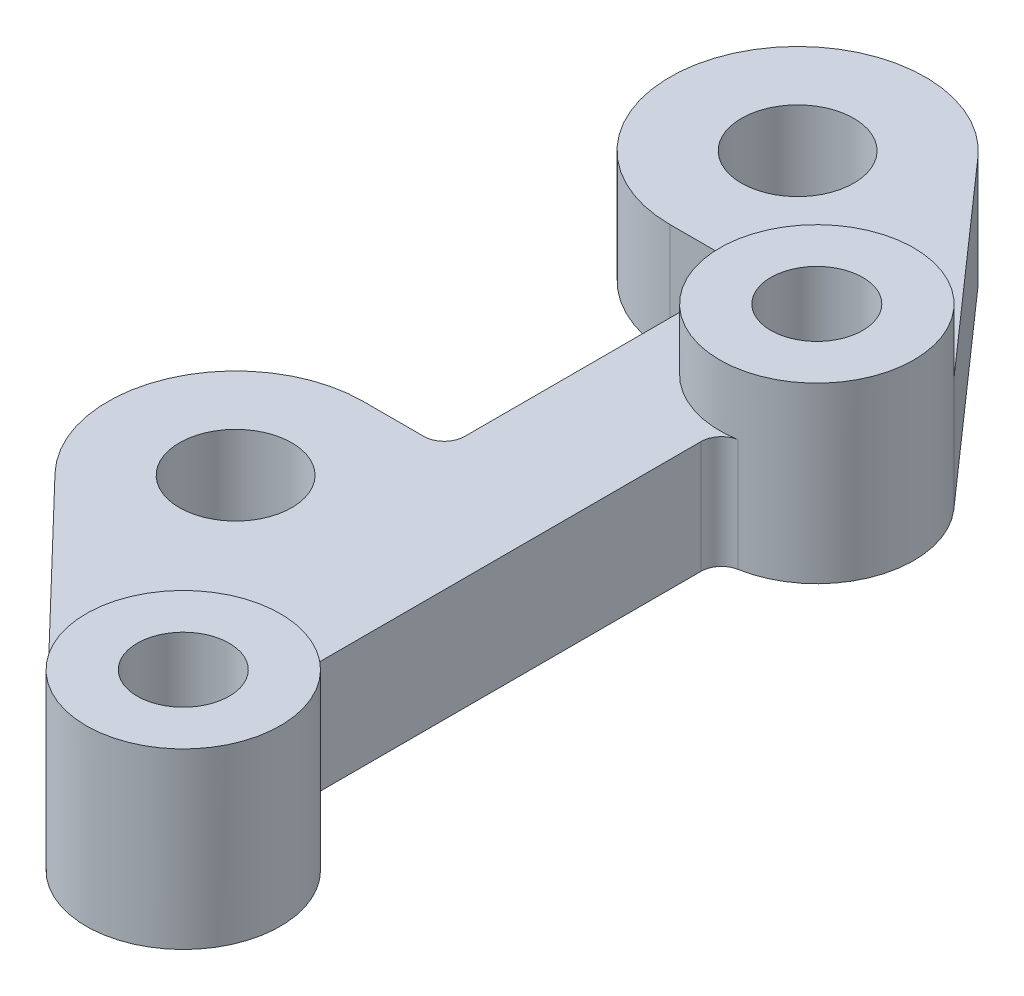
ISO-10303-21;
HEADER;
FILE_DESCRIPTION(('STEP AP214'),'2;1');
FILE_NAME('part.step','',(''),(''),'','','');
FILE_SCHEMA(('AUTOMOTIVE_DESIGN { 1 0 10303 214 1 1 1 1 }'));
ENDSEC;
DATA;
#1=APPLICATION_CONTEXT('core data for automotive mechanical design processes');
#2=APPLICATION_PROTOCOL_DEFINITION('international standard','automotive_design',2000,#1);
#3=PRODUCT_CONTEXT('',#1,'mechanical');
#4=PRODUCT('Part','Part','',(#3));
#5=PRODUCT_RELATED_PRODUCT_CATEGORY('part','',(#4));
#6=PRODUCT_DEFINITION_FORMATION('','',#4);
#7=PRODUCT_DEFINITION_CONTEXT('part definition',#1,'design');
#8=PRODUCT_DEFINITION('design','',#6,#7);
#9=PRODUCT_DEFINITION_SHAPE('','',#8);
#10=(LENGTH_UNIT() NAMED_UNIT(*) SI_UNIT(.MILLI.,.METRE.));
#11=(NAMED_UNIT(*) PLANE_ANGLE_UNIT() SI_UNIT($,.RADIAN.));
#12=(NAMED_UNIT(*) SI_UNIT($,.STERADIAN.) SOLID_ANGLE_UNIT());
#13=UNCERTAINTY_MEASURE_WITH_UNIT(LENGTH_MEASURE(1.E-05),#10,'distance_accuracy_value','');
#14=(GEOMETRIC_REPRESENTATION_CONTEXT(3) GLOBAL_UNCERTAINTY_ASSIGNED_CONTEXT((#13)) GLOBAL_UNIT_ASSIGNED_CONTEXT((#10,
#11,#12)) REPRESENTATION_CONTEXT('',''));
#15=CARTESIAN_POINT('',(0.,0.,0.));
#16=DIRECTION('',(0.,0.,1.));
#17=DIRECTION('',(1.,0.,0.));
#18=AXIS2_PLACEMENT_3D('',#15,#16,#17);
#19=CARTESIAN_POINT('',(-19.9204683724037,11.,-80.0434610192774));
#20=DIRECTION('',(0.,-1.,0.));
#21=DIRECTION('',(0.,0.,-1.));
#22=AXIS2_PLACEMENT_3D('',#19,#20,#21);
#23=PLANE('',#22);
#24=CARTESIAN_POINT('',(-19.9204683724037,11.,-25.0434610192774));
#25=DIRECTION('',(0.,1.,0.));
#26=DIRECTION('',(0.,0.,1.));
#27=AXIS2_PLACEMENT_3D('',#24,#25,#26);
#28=CIRCLE('',#27,5.5);
#29=CARTESIAN_POINT('',(-19.9204683724037,11.,-19.5434610192774));
#30=VERTEX_POINT('',#29);
#31=EDGE_CURVE('E303',#30,#30,#28,.T.);
#32=ORIENTED_EDGE('',*,*,#31,.F.);
#33=EDGE_LOOP('',(#32));
#34=FACE_BOUND('',#33,.T.);
#35=CARTESIAN_POINT('',(-19.9204683724037,11.,-80.0434610192774));
#36=DIRECTION('',(0.,1.,0.));
#37=DIRECTION('',(0.,0.,1.));
#38=AXIS2_PLACEMENT_3D('',#35,#36,#37);
#39=CIRCLE('',#38,5.50000000000001);
#40=CARTESIAN_POINT('',(-19.9204683724037,11.,-74.5434610192773));
#41=VERTEX_POINT('',#40);
#42=EDGE_CURVE('E294',#41,#41,#39,.T.);
#43=ORIENTED_EDGE('',*,*,#42,.F.);
#44=EDGE_LOOP('',(#43));
#45=FACE_BOUND('',#44,.T.);
#46=CARTESIAN_POINT('',(0.,11.,-62.));
#47=DIRECTION('',(0.,1.,0.));
#48=DIRECTION('',(0.,0.,1.));
#49=AXIS2_PLACEMENT_3D('',#46,#47,#48);
#50=CIRCLE('',#49,9.49999999999999);
#51=CARTESIAN_POINT('',(7.12365328024054,11.,-68.2851860706679));
#52=VERTEX_POINT('',#51);
#53=CARTESIAN_POINT('',(1.65217391304348,11.,-52.6447703736862));
#54=VERTEX_POINT('',#53);
#55=EDGE_CURVE('E532',#52,#54,#50,.T.);
#56=ORIENTED_EDGE('',*,*,#55,.F.);
#57=DIRECTION('',(-0.661598533754519,0.,-0.74985824002532));
#58=VECTOR('',#57,1.);
#59=CARTESIAN_POINT('',(7.12365328024054,11.,-68.2851860706679));
#60=LINE('',#59,#58);
#61=CARTESIAN_POINT('',(-10.5472403720872,11.,-88.3134426912088));
#62=VERTEX_POINT('',#61);
#63=EDGE_CURVE('E64',#52,#62,#60,.T.);
#64=ORIENTED_EDGE('',*,*,#63,.T.);
#65=CARTESIAN_POINT('',(-19.9204683724037,11.,-80.0434610192774));
#66=DIRECTION('',(0.,1.,0.));
#67=DIRECTION('',(0.,0.,-1.));
#68=AXIS2_PLACEMENT_3D('',#65,#66,#67);
#69=CIRCLE('',#68,12.5);
#70=CARTESIAN_POINT('',(-19.9204683724037,11.,-67.5434610192774));
#71=VERTEX_POINT('',#70);
#72=EDGE_CURVE('E210',#62,#71,#69,.T.);
#73=ORIENTED_EDGE('',*,*,#72,.T.);
#74=DIRECTION('',(1.,0.,0.));
#75=VECTOR('',#74,1.);
#76=CARTESIAN_POINT('',(-19.9204683724037,11.,-67.5434610192774));
#77=LINE('',#76,#75);
#78=CARTESIAN_POINT('',(-14.,11.,-67.5434610192774));
#79=VERTEX_POINT('',#78);
#80=EDGE_CURVE('E127',#71,#79,#77,.T.);
#81=ORIENTED_EDGE('',*,*,#80,.T.);
#82=CARTESIAN_POINT('',(-14.,11.,-65.5434610192774));
#83=DIRECTION('',(0.,-1.,0.));
#84=DIRECTION('',(0.,0.,-1.));
#85=AXIS2_PLACEMENT_3D('',#82,#83,#84);
#86=CIRCLE('',#85,2.);
#87=CARTESIAN_POINT('',(-12.,11.,-65.5434610192774));
#88=VERTEX_POINT('',#87);
#89=EDGE_CURVE('E242',#79,#88,#86,.T.);
#90=ORIENTED_EDGE('',*,*,#89,.T.);
#91=DIRECTION('',(0.,0.,1.));
#92=VECTOR('',#91,1.);
#93=CARTESIAN_POINT('',(-12.,11.,-65.5434610192774));
#94=LINE('',#93,#92);
#95=CARTESIAN_POINT('',(-12.,11.,-39.5434610192774));
#96=VERTEX_POINT('',#95);
#97=EDGE_CURVE('E261',#88,#96,#94,.T.);
#98=ORIENTED_EDGE('',*,*,#97,.T.);
#99=CARTESIAN_POINT('',(-14.,11.,-39.5434610192774));
#100=DIRECTION('',(0.,-1.,0.));
#101=DIRECTION('',(0.,0.,1.));
#102=AXIS2_PLACEMENT_3D('',#99,#100,#101);
#103=CIRCLE('',#102,2.);
#104=CARTESIAN_POINT('',(-14.,11.,-37.5434610192774));
#105=VERTEX_POINT('',#104);
#106=EDGE_CURVE('E258',#96,#105,#103,.T.);
#107=ORIENTED_EDGE('',*,*,#106,.T.);
#108=DIRECTION('',(-1.,0.,0.));
#109=VECTOR('',#108,1.);
#110=CARTESIAN_POINT('',(-19.9204683724037,11.,-37.5434610192774));
#111=LINE('',#110,#109);
#112=CARTESIAN_POINT('',(-19.9204683724037,11.,-37.5434610192774));
#113=VERTEX_POINT('',#112);
#114=EDGE_CURVE('E260',#105,#113,#111,.T.);
#115=ORIENTED_EDGE('',*,*,#114,.T.);
#116=CARTESIAN_POINT('',(-19.9204683724037,11.,-25.0434610192774));
#117=DIRECTION('',(0.,1.,0.));
#118=DIRECTION('',(0.,0.,-1.));
#119=AXIS2_PLACEMENT_3D('',#116,#117,#118);
#120=CIRCLE('',#119,12.5);
#121=CARTESIAN_POINT('',(-28.9304761654841,11.,-16.3791803469636));
#122=VERTEX_POINT('',#121);
#123=EDGE_CURVE('E263',#113,#122,#120,.T.);
#124=ORIENTED_EDGE('',*,*,#123,.T.);
#125=DIRECTION('',(0.693142453785104,0.,0.720800623446432));
#126=VECTOR('',#125,1.);
#127=CARTESIAN_POINT('',(-28.9304761654841,11.,-16.3791803469636));
#128=LINE('',#127,#126);
#129=CARTESIAN_POINT('',(-6.84760592274112,11.,6.58485331095849));
#130=VERTEX_POINT('',#129);
#131=EDGE_CURVE('E269',#122,#130,#128,.T.);
#132=ORIENTED_EDGE('',*,*,#131,.T.);
#133=CARTESIAN_POINT('',(0.,11.,0.));
#134=DIRECTION('',(0.,1.,0.));
#135=DIRECTION('',(0.,0.,1.));
#136=AXIS2_PLACEMENT_3D('',#133,#134,#135);
#137=CIRCLE('',#136,9.50000000000001);
#138=CARTESIAN_POINT('',(1.65217391304348,11.,-9.35522962631376));
#139=VERTEX_POINT('',#138);
#140=EDGE_CURVE('E273',#139,#130,#137,.T.);
#141=ORIENTED_EDGE('',*,*,#140,.F.);
#142=CARTESIAN_POINT('',(2.,11.,-11.3247516529061));
#143=DIRECTION('',(0.,-1.,0.));
#144=DIRECTION('',(0.,0.,-1.));
#145=AXIS2_PLACEMENT_3D('',#142,#143,#144);
#146=CIRCLE('',#145,2.);
#147=CARTESIAN_POINT('',(0.,11.,-11.3247516529061));
#148=VERTEX_POINT('',#147);
#149=EDGE_CURVE('E161',#139,#148,#146,.T.);
#150=ORIENTED_EDGE('',*,*,#149,.T.);
#151=DIRECTION('',(0.,0.,-1.));
#152=VECTOR('',#151,1.);
#153=CARTESIAN_POINT('',(0.,11.,-50.6752483470939));
#154=LINE('',#153,#152);
#155=CARTESIAN_POINT('',(0.,11.,-50.6752483470939));
#156=VERTEX_POINT('',#155);
#157=EDGE_CURVE('E154',#148,#156,#154,.T.);
#158=ORIENTED_EDGE('',*,*,#157,.T.);
#159=CARTESIAN_POINT('',(2.,11.,-50.6752483470939));
#160=DIRECTION('',(0.,-1.,0.));
#161=DIRECTION('',(0.,0.,-1.));
#162=AXIS2_PLACEMENT_3D('',#159,#160,#161);
#163=CIRCLE('',#162,2.);
#164=EDGE_CURVE('E157',#156,#54,#163,.T.);
#165=ORIENTED_EDGE('',*,*,#164,.T.);
#166=EDGE_LOOP('',(#56,#64,#73,#81,#90,#98,#107,#115,#124,#132,#141,#150,#158,#165));
#167=FACE_BOUND('',#166,.T.);
#168=ADVANCED_FACE('F47',(#34,#45,#167),#23,.F.);
#169=CARTESIAN_POINT('',(-19.9204683724037,0.,-80.0434610192774));
#170=DIRECTION('',(0.,-1.,0.));
#171=DIRECTION('',(0.,0.,-1.));
#172=AXIS2_PLACEMENT_3D('',#169,#170,#171);
#173=PLANE('',#172);
#174=CARTESIAN_POINT('',(0.,0.,-62.));
#175=DIRECTION('',(0.,1.,0.));
#176=DIRECTION('',(0.,0.,1.));
#177=AXIS2_PLACEMENT_3D('',#174,#175,#176);
#178=CIRCLE('',#177,4.5);
#179=CARTESIAN_POINT('',(0.,0.,-57.5));
#180=VERTEX_POINT('',#179);
#181=EDGE_CURVE('E297',#180,#180,#178,.T.);
#182=ORIENTED_EDGE('',*,*,#181,.T.);
#183=EDGE_LOOP('',(#182));
#184=FACE_BOUND('',#183,.T.);
#185=CARTESIAN_POINT('',(0.,0.,0.));
#186=DIRECTION('',(0.,1.,0.));
#187=DIRECTION('',(0.,0.,1.));
#188=AXIS2_PLACEMENT_3D('',#185,#186,#187);
#189=CIRCLE('',#188,4.5);
#190=CARTESIAN_POINT('',(0.,0.,4.5));
#191=VERTEX_POINT('',#190);
#192=EDGE_CURVE('E187',#191,#191,#189,.T.);
#193=ORIENTED_EDGE('',*,*,#192,.T.);
#194=EDGE_LOOP('',(#193));
#195=FACE_BOUND('',#194,.T.);
#196=CARTESIAN_POINT('',(-19.9204683724037,0.,-80.0434610192774));
#197=DIRECTION('',(0.,1.,0.));
#198=DIRECTION('',(0.,0.,-1.));
#199=AXIS2_PLACEMENT_3D('',#196,#197,#198);
#200=CIRCLE('',#199,12.5);
#201=CARTESIAN_POINT('',(-10.5472403720872,0.,-88.3134426912088));
#202=VERTEX_POINT('',#201);
#203=CARTESIAN_POINT('',(-19.9204683724037,0.,-67.5434610192774));
#204=VERTEX_POINT('',#203);
#205=EDGE_CURVE('E183',#202,#204,#200,.T.);
#206=ORIENTED_EDGE('',*,*,#205,.F.);
#207=DIRECTION('',(-0.661598533754519,0.,-0.74985824002532));
#208=VECTOR('',#207,1.);
#209=CARTESIAN_POINT('',(7.12365328024054,0.,-68.2851860706679));
#210=LINE('',#209,#208);
#211=CARTESIAN_POINT('',(7.12365328024054,0.,-68.2851860706679));
#212=VERTEX_POINT('',#211);
#213=EDGE_CURVE('E119',#212,#202,#210,.T.);
#214=ORIENTED_EDGE('',*,*,#213,.F.);
#215=CARTESIAN_POINT('',(0.,0.,-62.));
#216=DIRECTION('',(0.,1.,0.));
#217=DIRECTION('',(0.,0.,1.));
#218=AXIS2_PLACEMENT_3D('',#215,#216,#217);
#219=CIRCLE('',#218,9.5);
#220=CARTESIAN_POINT('',(1.65217391304348,0.,-52.6447703736862));
#221=VERTEX_POINT('',#220);
#222=EDGE_CURVE('E113',#221,#212,#219,.T.);
#223=ORIENTED_EDGE('',*,*,#222,.F.);
#224=CARTESIAN_POINT('',(2.,0.,-50.6752483470939));
#225=DIRECTION('',(0.,-1.,0.));
#226=DIRECTION('',(0.,0.,-1.));
#227=AXIS2_PLACEMENT_3D('',#224,#225,#226);
#228=CIRCLE('',#227,2.);
#229=CARTESIAN_POINT('',(0.,0.,-50.6752483470939));
#230=VERTEX_POINT('',#229);
#231=EDGE_CURVE('E206',#230,#221,#228,.T.);
#232=ORIENTED_EDGE('',*,*,#231,.F.);
#233=DIRECTION('',(0.,0.,-1.));
#234=VECTOR('',#233,1.);
#235=CARTESIAN_POINT('',(0.,0.,-50.6752483470939));
#236=LINE('',#235,#234);
#237=CARTESIAN_POINT('',(0.,0.,-11.3247516529061));
#238=VERTEX_POINT('',#237);
#239=EDGE_CURVE('E170',#238,#230,#236,.T.);
#240=ORIENTED_EDGE('',*,*,#239,.F.);
#241=CARTESIAN_POINT('',(2.,0.,-11.3247516529061));
#242=DIRECTION('',(0.,-1.,0.));
#243=DIRECTION('',(0.,0.,-1.));
#244=AXIS2_PLACEMENT_3D('',#241,#242,#243);
#245=CIRCLE('',#244,2.);
#246=CARTESIAN_POINT('',(1.65217391304348,0.,-9.35522962631376));
#247=VERTEX_POINT('',#246);
#248=EDGE_CURVE('E203',#247,#238,#245,.T.);
#249=ORIENTED_EDGE('',*,*,#248,.F.);
#250=CARTESIAN_POINT('',(0.,0.,0.));
#251=DIRECTION('',(0.,1.,0.));
#252=DIRECTION('',(0.,0.,1.));
#253=AXIS2_PLACEMENT_3D('',#250,#251,#252);
#254=CIRCLE('',#253,9.50000000000001);
#255=CARTESIAN_POINT('',(-6.84760592274112,0.,6.58485331095849));
#256=VERTEX_POINT('',#255);
#257=EDGE_CURVE('E201',#256,#247,#254,.T.);
#258=ORIENTED_EDGE('',*,*,#257,.F.);
#259=DIRECTION('',(0.693142453785104,0.,0.720800623446432));
#260=VECTOR('',#259,1.);
#261=CARTESIAN_POINT('',(-28.9304761654841,0.,-16.3791803469636));
#262=LINE('',#261,#260);
#263=CARTESIAN_POINT('',(-28.9304761654841,0.,-16.3791803469636));
#264=VERTEX_POINT('',#263);
#265=EDGE_CURVE('E199',#264,#256,#262,.T.);
#266=ORIENTED_EDGE('',*,*,#265,.F.);
#267=CARTESIAN_POINT('',(-19.9204683724037,0.,-25.0434610192774));
#268=DIRECTION('',(0.,1.,0.));
#269=DIRECTION('',(0.,0.,-1.));
#270=AXIS2_PLACEMENT_3D('',#267,#268,#269);
#271=CIRCLE('',#270,12.5);
#272=CARTESIAN_POINT('',(-19.9204683724037,0.,-37.5434610192774));
#273=VERTEX_POINT('',#272);
#274=EDGE_CURVE('E197',#273,#264,#271,.T.);
#275=ORIENTED_EDGE('',*,*,#274,.F.);
#276=DIRECTION('',(-1.,0.,0.));
#277=VECTOR('',#276,1.);
#278=CARTESIAN_POINT('',(-19.9204683724037,0.,-37.5434610192774));
#279=LINE('',#278,#277);
#280=CARTESIAN_POINT('',(-14.,0.,-37.5434610192774));
#281=VERTEX_POINT('',#280);
#282=EDGE_CURVE('E195',#281,#273,#279,.T.);
#283=ORIENTED_EDGE('',*,*,#282,.F.);
#284=CARTESIAN_POINT('',(-14.,0.,-39.5434610192774));
#285=DIRECTION('',(0.,-1.,0.));
#286=DIRECTION('',(0.,0.,1.));
#287=AXIS2_PLACEMENT_3D('',#284,#285,#286);
#288=CIRCLE('',#287,2.);
#289=CARTESIAN_POINT('',(-12.,0.,-39.5434610192774));
#290=VERTEX_POINT('',#289);
#291=EDGE_CURVE('E193',#290,#281,#288,.T.);
#292=ORIENTED_EDGE('',*,*,#291,.F.);
#293=DIRECTION('',(0.,0.,1.));
#294=VECTOR('',#293,1.);
#295=CARTESIAN_POINT('',(-12.,0.,-65.5434610192774));
#296=LINE('',#295,#294);
#297=CARTESIAN_POINT('',(-12.,0.,-65.5434610192774));
#298=VERTEX_POINT('',#297);
#299=EDGE_CURVE('E191',#298,#290,#296,.T.);
#300=ORIENTED_EDGE('',*,*,#299,.F.);
#301=CARTESIAN_POINT('',(-14.,0.,-65.5434610192774));
#302=DIRECTION('',(0.,-1.,0.));
#303=DIRECTION('',(0.,0.,-1.));
#304=AXIS2_PLACEMENT_3D('',#301,#302,#303);
#305=CIRCLE('',#304,2.);
#306=CARTESIAN_POINT('',(-14.,0.,-67.5434610192774));
#307=VERTEX_POINT('',#306);
#308=EDGE_CURVE('E189',#307,#298,#305,.T.);
#309=ORIENTED_EDGE('',*,*,#308,.F.);
#310=DIRECTION('',(1.,0.,0.));
#311=VECTOR('',#310,1.);
#312=CARTESIAN_POINT('',(-19.9204683724037,0.,-67.5434610192774));
#313=LINE('',#312,#311);
#314=EDGE_CURVE('E186',#204,#307,#313,.T.);
#315=ORIENTED_EDGE('',*,*,#314,.F.);
#316=EDGE_LOOP('',(#206,#214,#223,#232,#240,#249,#258,#266,#275,#283,#292,#300,#309,#315));
#317=FACE_BOUND('',#316,.T.);
#318=CARTESIAN_POINT('',(-19.9204683724037,0.,-25.0434610192774));
#319=DIRECTION('',(0.,1.,0.));
#320=DIRECTION('',(0.,0.,1.));
#321=AXIS2_PLACEMENT_3D('',#318,#319,#320);
#322=CIRCLE('',#321,5.5);
#323=CARTESIAN_POINT('',(-19.9204683724037,0.,-19.5434610192774));
#324=VERTEX_POINT('',#323);
#325=EDGE_CURVE('E302',#324,#324,#322,.T.);
#326=ORIENTED_EDGE('',*,*,#325,.T.);
#327=EDGE_LOOP('',(#326));
#328=FACE_BOUND('',#327,.T.);
#329=CARTESIAN_POINT('',(-19.9204683724037,0.,-80.0434610192774));
#330=DIRECTION('',(0.,1.,0.));
#331=DIRECTION('',(0.,0.,1.));
#332=AXIS2_PLACEMENT_3D('',#329,#330,#331);
#333=CIRCLE('',#332,5.50000000000001);
#334=CARTESIAN_POINT('',(-19.9204683724037,0.,-74.5434610192773));
#335=VERTEX_POINT('',#334);
#336=EDGE_CURVE('E288',#335,#335,#333,.T.);
#337=ORIENTED_EDGE('',*,*,#336,.T.);
#338=EDGE_LOOP('',(#337));
#339=FACE_BOUND('',#338,.T.);
#340=ADVANCED_FACE('F246',(#184,#195,#317,#328,#339),#173,.T.);
#341=CARTESIAN_POINT('',(-19.9204683724037,11.,-80.0434610192774));
#342=DIRECTION('',(0.,-1.,0.));
#343=DIRECTION('',(0.,0.,-1.));
#344=AXIS2_PLACEMENT_3D('',#341,#342,#343);
#345=CYLINDRICAL_SURFACE('',#344,12.5);
#346=ORIENTED_EDGE('',*,*,#205,.T.);
#347=DIRECTION('',(0.,-1.,0.));
#348=VECTOR('',#347,1.);
#349=CARTESIAN_POINT('',(-19.9204683724037,11.,-67.5434610192774));
#350=LINE('',#349,#348);
#351=EDGE_CURVE('E13',#71,#204,#350,.T.);
#352=ORIENTED_EDGE('',*,*,#351,.F.);
#353=ORIENTED_EDGE('',*,*,#72,.F.);
#354=DIRECTION('',(0.,-1.,0.));
#355=VECTOR('',#354,1.);
#356=CARTESIAN_POINT('',(-10.5472403720872,11.,-88.3134426912088));
#357=LINE('',#356,#355);
#358=EDGE_CURVE('E179',#62,#202,#357,.T.);
#359=ORIENTED_EDGE('',*,*,#358,.T.);
#360=EDGE_LOOP('',(#346,#352,#353,#359));
#361=FACE_BOUND('',#360,.T.);
#362=ADVANCED_FACE('F49',(#361),#345,.T.);
#363=CARTESIAN_POINT('',(-19.9204683724037,11.,-67.5434610192774));
#364=DIRECTION('',(0.,0.,-1.));
#365=DIRECTION('',(-1.,0.,0.));
#366=AXIS2_PLACEMENT_3D('',#363,#364,#365);
#367=PLANE('',#366);
#368=ORIENTED_EDGE('',*,*,#314,.T.);
#369=DIRECTION('',(0.,-1.,0.));
#370=VECTOR('',#369,1.);
#371=CARTESIAN_POINT('',(-14.,11.,-67.5434610192774));
#372=LINE('',#371,#370);
#373=EDGE_CURVE('E56',#79,#307,#372,.T.);
#374=ORIENTED_EDGE('',*,*,#373,.F.);
#375=ORIENTED_EDGE('',*,*,#80,.F.);
#376=ORIENTED_EDGE('',*,*,#351,.T.);
#377=EDGE_LOOP('',(#368,#374,#375,#376));
#378=FACE_BOUND('',#377,.T.);
#379=ADVANCED_FACE('F314',(#378),#367,.F.);
#380=CARTESIAN_POINT('',(-14.,11.,-65.5434610192774));
#381=DIRECTION('',(0.,-1.,0.));
#382=DIRECTION('',(0.,0.,-1.));
#383=AXIS2_PLACEMENT_3D('',#380,#381,#382);
#384=CYLINDRICAL_SURFACE('',#383,2.);
#385=ORIENTED_EDGE('',*,*,#308,.T.);
#386=DIRECTION('',(0.,-1.,0.));
#387=VECTOR('',#386,1.);
#388=CARTESIAN_POINT('',(-12.,11.,-65.5434610192774));
#389=LINE('',#388,#387);
#390=EDGE_CURVE('E234',#88,#298,#389,.T.);
#391=ORIENTED_EDGE('',*,*,#390,.F.);
#392=ORIENTED_EDGE('',*,*,#89,.F.);
#393=ORIENTED_EDGE('',*,*,#373,.T.);
#394=EDGE_LOOP('',(#385,#391,#392,#393));
#395=FACE_BOUND('',#394,.T.);
#396=ADVANCED_FACE('F240',(#395),#384,.F.);
#397=CARTESIAN_POINT('',(-12.,11.,-65.5434610192774));
#398=DIRECTION('',(1.,0.,0.));
#399=DIRECTION('',(0.,0.,-1.));
#400=AXIS2_PLACEMENT_3D('',#397,#398,#399);
#401=PLANE('',#400);
#402=ORIENTED_EDGE('',*,*,#299,.T.);
#403=DIRECTION('',(0.,-1.,0.));
#404=VECTOR('',#403,1.);
#405=CARTESIAN_POINT('',(-12.,11.,-39.5434610192774));
#406=LINE('',#405,#404);
#407=EDGE_CURVE('E231',#96,#290,#406,.T.);
#408=ORIENTED_EDGE('',*,*,#407,.F.);
#409=ORIENTED_EDGE('',*,*,#97,.F.);
#410=ORIENTED_EDGE('',*,*,#390,.T.);
#411=EDGE_LOOP('',(#402,#408,#409,#410));
#412=FACE_BOUND('',#411,.T.);
#413=ADVANCED_FACE('F252',(#412),#401,.F.);
#414=CARTESIAN_POINT('',(-14.,11.,-39.5434610192774));
#415=DIRECTION('',(0.,-1.,0.));
#416=DIRECTION('',(0.,0.,-1.));
#417=AXIS2_PLACEMENT_3D('',#414,#415,#416);
#418=CYLINDRICAL_SURFACE('',#417,2.);
#419=ORIENTED_EDGE('',*,*,#291,.T.);
#420=DIRECTION('',(0.,-1.,0.));
#421=VECTOR('',#420,1.);
#422=CARTESIAN_POINT('',(-14.,11.,-37.5434610192774));
#423=LINE('',#422,#421);
#424=EDGE_CURVE('E228',#105,#281,#423,.T.);
#425=ORIENTED_EDGE('',*,*,#424,.F.);
#426=ORIENTED_EDGE('',*,*,#106,.F.);
#427=ORIENTED_EDGE('',*,*,#407,.T.);
#428=EDGE_LOOP('',(#419,#425,#426,#427));
#429=FACE_BOUND('',#428,.T.);
#430=ADVANCED_FACE('F256',(#429),#418,.F.);
#431=CARTESIAN_POINT('',(-19.9204683724037,11.,-37.5434610192774));
#432=DIRECTION('',(0.,0.,1.));
#433=DIRECTION('',(1.,0.,0.));
#434=AXIS2_PLACEMENT_3D('',#431,#432,#433);
#435=PLANE('',#434);
#436=ORIENTED_EDGE('',*,*,#282,.T.);
#437=DIRECTION('',(0.,-1.,0.));
#438=VECTOR('',#437,1.);
#439=CARTESIAN_POINT('',(-19.9204683724037,11.,-37.5434610192774));
#440=LINE('',#439,#438);
#441=EDGE_CURVE('E225',#113,#273,#440,.T.);
#442=ORIENTED_EDGE('',*,*,#441,.F.);
#443=ORIENTED_EDGE('',*,*,#114,.F.);
#444=ORIENTED_EDGE('',*,*,#424,.T.);
#445=EDGE_LOOP('',(#436,#442,#443,#444));
#446=FACE_BOUND('',#445,.T.);
#447=ADVANCED_FACE('F356',(#446),#435,.F.);
#448=CARTESIAN_POINT('',(-19.9204683724037,11.,-25.0434610192774));
#449=DIRECTION('',(0.,-1.,0.));
#450=DIRECTION('',(0.,0.,-1.));
#451=AXIS2_PLACEMENT_3D('',#448,#449,#450);
#452=CYLINDRICAL_SURFACE('',#451,12.5);
#453=ORIENTED_EDGE('',*,*,#274,.T.);
#454=DIRECTION('',(0.,-1.,0.));
#455=VECTOR('',#454,1.);
#456=CARTESIAN_POINT('',(-28.9304761654841,11.,-16.3791803469636));
#457=LINE('',#456,#455);
#458=EDGE_CURVE('E222',#122,#264,#457,.T.);
#459=ORIENTED_EDGE('',*,*,#458,.F.);
#460=ORIENTED_EDGE('',*,*,#123,.F.);
#461=ORIENTED_EDGE('',*,*,#441,.T.);
#462=EDGE_LOOP('',(#453,#459,#460,#461));
#463=FACE_BOUND('',#462,.T.);
#464=ADVANCED_FACE('F353',(#463),#452,.T.);
#465=CARTESIAN_POINT('',(-28.9304761654841,11.,-16.3791803469636));
#466=DIRECTION('',(0.720800623446432,0.,-0.693142453785104));
#467=DIRECTION('',(-0.693142453785104,0.,-0.720800623446432));
#468=AXIS2_PLACEMENT_3D('',#465,#466,#467);
#469=PLANE('',#468);
#470=ORIENTED_EDGE('',*,*,#265,.T.);
#471=DIRECTION('',(0.,-1.,0.));
#472=VECTOR('',#471,1.);
#473=CARTESIAN_POINT('',(-6.84760592274112,11.,6.58485331095849));
#474=LINE('',#473,#472);
#475=EDGE_CURVE('E219',#130,#256,#474,.T.);
#476=ORIENTED_EDGE('',*,*,#475,.F.);
#477=ORIENTED_EDGE('',*,*,#131,.F.);
#478=ORIENTED_EDGE('',*,*,#458,.T.);
#479=EDGE_LOOP('',(#470,#476,#477,#478));
#480=FACE_BOUND('',#479,.T.);
#481=ADVANCED_FACE('F277',(#480),#469,.F.);
#482=CARTESIAN_POINT('',(0.,11.,0.));
#483=DIRECTION('',(0.,-1.,0.));
#484=DIRECTION('',(0.,0.,-1.));
#485=AXIS2_PLACEMENT_3D('',#482,#483,#484);
#486=CYLINDRICAL_SURFACE('',#485,9.50000000000001);
#487=ORIENTED_EDGE('',*,*,#257,.T.);
#488=DIRECTION('',(0.,-1.,0.));
#489=VECTOR('',#488,1.);
#490=CARTESIAN_POINT('',(1.65217391304348,11.,-9.35522962631376));
#491=LINE('',#490,#489);
#492=EDGE_CURVE('E216',#139,#247,#491,.T.);
#493=ORIENTED_EDGE('',*,*,#492,.F.);
#494=ORIENTED_EDGE('',*,*,#140,.T.);
#495=ORIENTED_EDGE('',*,*,#475,.T.);
#496=EDGE_LOOP('',(#487,#493,#494,#495));
#497=FACE_BOUND('',#496,.T.);
#498=CARTESIAN_POINT('',(0.,17.,0.));
#499=DIRECTION('',(0.,1.,0.));
#500=DIRECTION('',(0.,0.,1.));
#501=AXIS2_PLACEMENT_3D('',#498,#499,#500);
#502=CIRCLE('',#501,9.50000000000001);
#503=CARTESIAN_POINT('',(0.,17.,9.50000000000001));
#504=VERTEX_POINT('',#503);
#505=EDGE_CURVE('E284',#504,#504,#502,.T.);
#506=ORIENTED_EDGE('',*,*,#505,.F.);
#507=EDGE_LOOP('',(#506));
#508=FACE_BOUND('',#507,.T.);
#509=ADVANCED_FACE('F282',(#497,#508),#486,.T.);
#510=CARTESIAN_POINT('',(2.,11.,-11.3247516529061));
#511=DIRECTION('',(0.,-1.,0.));
#512=DIRECTION('',(0.,0.,-1.));
#513=AXIS2_PLACEMENT_3D('',#510,#511,#512);
#514=CYLINDRICAL_SURFACE('',#513,2.);
#515=ORIENTED_EDGE('',*,*,#248,.T.);
#516=DIRECTION('',(0.,-1.,0.));
#517=VECTOR('',#516,1.);
#518=CARTESIAN_POINT('',(0.,11.,-11.3247516529061));
#519=LINE('',#518,#517);
#520=EDGE_CURVE('E173',#148,#238,#519,.T.);
#521=ORIENTED_EDGE('',*,*,#520,.F.);
#522=ORIENTED_EDGE('',*,*,#149,.F.);
#523=ORIENTED_EDGE('',*,*,#492,.T.);
#524=EDGE_LOOP('',(#515,#521,#522,#523));
#525=FACE_BOUND('',#524,.T.);
#526=ADVANCED_FACE('F345',(#525),#514,.F.);
#527=CARTESIAN_POINT('',(0.,11.,-50.6752483470939));
#528=DIRECTION('',(-1.,0.,0.));
#529=DIRECTION('',(0.,0.,1.));
#530=AXIS2_PLACEMENT_3D('',#527,#528,#529);
#531=PLANE('',#530);
#532=ORIENTED_EDGE('',*,*,#239,.T.);
#533=DIRECTION('',(0.,-1.,0.));
#534=VECTOR('',#533,1.);
#535=CARTESIAN_POINT('',(0.,11.,-50.6752483470939));
#536=LINE('',#535,#534);
#537=EDGE_CURVE('E167',#156,#230,#536,.T.);
#538=ORIENTED_EDGE('',*,*,#537,.F.);
#539=ORIENTED_EDGE('',*,*,#157,.F.);
#540=ORIENTED_EDGE('',*,*,#520,.T.);
#541=EDGE_LOOP('',(#532,#538,#539,#540));
#542=FACE_BOUND('',#541,.T.);
#543=ADVANCED_FACE('F168',(#542),#531,.F.);
#544=CARTESIAN_POINT('',(2.,11.,-50.6752483470939));
#545=DIRECTION('',(0.,-1.,0.));
#546=DIRECTION('',(0.,0.,-1.));
#547=AXIS2_PLACEMENT_3D('',#544,#545,#546);
#548=CYLINDRICAL_SURFACE('',#547,2.);
#549=ORIENTED_EDGE('',*,*,#231,.T.);
#550=DIRECTION('',(0.,-1.,0.));
#551=VECTOR('',#550,1.);
#552=CARTESIAN_POINT('',(1.65217391304348,11.,-52.6447703736862));
#553=LINE('',#552,#551);
#554=EDGE_CURVE('E174',#54,#221,#553,.T.);
#555=ORIENTED_EDGE('',*,*,#554,.F.);
#556=ORIENTED_EDGE('',*,*,#164,.F.);
#557=ORIENTED_EDGE('',*,*,#537,.T.);
#558=EDGE_LOOP('',(#549,#555,#556,#557));
#559=FACE_BOUND('',#558,.T.);
#560=ADVANCED_FACE('F176',(#559),#548,.F.);
#561=CARTESIAN_POINT('',(0.,11.,-62.));
#562=DIRECTION('',(0.,-1.,0.));
#563=DIRECTION('',(0.,0.,-1.));
#564=AXIS2_PLACEMENT_3D('',#561,#562,#563);
#565=CYLINDRICAL_SURFACE('',#564,9.5);
#566=ORIENTED_EDGE('',*,*,#222,.T.);
#567=DIRECTION('',(0.,-1.,0.));
#568=VECTOR('',#567,1.);
#569=CARTESIAN_POINT('',(7.12365328024054,11.,-68.2851860706679));
#570=LINE('',#569,#568);
#571=EDGE_CURVE('E212',#52,#212,#570,.T.);
#572=ORIENTED_EDGE('',*,*,#571,.F.);
#573=ORIENTED_EDGE('',*,*,#55,.T.);
#574=ORIENTED_EDGE('',*,*,#554,.T.);
#575=EDGE_LOOP('',(#566,#572,#573,#574));
#576=FACE_BOUND('',#575,.T.);
#577=CARTESIAN_POINT('',(0.,17.,-62.));
#578=DIRECTION('',(0.,1.,0.));
#579=DIRECTION('',(0.,0.,1.));
#580=AXIS2_PLACEMENT_3D('',#577,#578,#579);
#581=CIRCLE('',#580,9.49999999999999);
#582=CARTESIAN_POINT('',(0.,17.,-52.5));
#583=VERTEX_POINT('',#582);
#584=EDGE_CURVE('E291',#583,#583,#581,.T.);
#585=ORIENTED_EDGE('',*,*,#584,.F.);
#586=EDGE_LOOP('',(#585));
#587=FACE_BOUND('',#586,.T.);
#588=ADVANCED_FACE('F338',(#576,#587),#565,.T.);
#589=CARTESIAN_POINT('',(7.12365328024054,11.,-68.2851860706679));
#590=DIRECTION('',(-0.74985824002532,0.,0.661598533754519));
#591=DIRECTION('',(0.661598533754519,0.,0.74985824002532));
#592=AXIS2_PLACEMENT_3D('',#589,#590,#591);
#593=PLANE('',#592);
#594=ORIENTED_EDGE('',*,*,#213,.T.);
#595=ORIENTED_EDGE('',*,*,#358,.F.);
#596=ORIENTED_EDGE('',*,*,#63,.F.);
#597=ORIENTED_EDGE('',*,*,#571,.T.);
#598=EDGE_LOOP('',(#594,#595,#596,#597));
#599=FACE_BOUND('',#598,.T.);
#600=ADVANCED_FACE('F335',(#599),#593,.F.);
#601=CARTESIAN_POINT('',(0.,11.,0.));
#602=DIRECTION('',(0.,-1.,0.));
#603=DIRECTION('',(0.,0.,-1.));
#604=AXIS2_PLACEMENT_3D('',#601,#602,#603);
#605=CYLINDRICAL_SURFACE('',#604,4.5);
#606=ORIENTED_EDGE('',*,*,#192,.F.);
#607=EDGE_LOOP('',(#606));
#608=FACE_BOUND('',#607,.T.);
#609=CARTESIAN_POINT('',(0.,17.,0.));
#610=DIRECTION('',(0.,1.,0.));
#611=DIRECTION('',(0.,0.,1.));
#612=AXIS2_PLACEMENT_3D('',#609,#610,#611);
#613=CIRCLE('',#612,4.5);
#614=CARTESIAN_POINT('',(0.,17.,4.5));
#615=VERTEX_POINT('',#614);
#616=EDGE_CURVE('E285',#615,#615,#613,.T.);
#617=ORIENTED_EDGE('',*,*,#616,.T.);
#618=EDGE_LOOP('',(#617));
#619=FACE_BOUND('',#618,.T.);
#620=ADVANCED_FACE('F332',(#608,#619),#605,.F.);
#621=CARTESIAN_POINT('',(-19.9204683724037,11.,-25.0434610192774));
#622=DIRECTION('',(0.,-1.,0.));
#623=DIRECTION('',(0.,0.,-1.));
#624=AXIS2_PLACEMENT_3D('',#621,#622,#623);
#625=CYLINDRICAL_SURFACE('',#624,5.5);
#626=ORIENTED_EDGE('',*,*,#31,.T.);
#627=EDGE_LOOP('',(#626));
#628=FACE_BOUND('',#627,.T.);
#629=ORIENTED_EDGE('',*,*,#325,.F.);
#630=EDGE_LOOP('',(#629));
#631=FACE_BOUND('',#630,.T.);
#632=ADVANCED_FACE('F415',(#628,#631),#625,.F.);
#633=CARTESIAN_POINT('',(0.,11.,-62.));
#634=DIRECTION('',(0.,-1.,0.));
#635=DIRECTION('',(0.,0.,-1.));
#636=AXIS2_PLACEMENT_3D('',#633,#634,#635);
#637=CYLINDRICAL_SURFACE('',#636,4.5);
#638=ORIENTED_EDGE('',*,*,#181,.F.);
#639=EDGE_LOOP('',(#638));
#640=FACE_BOUND('',#639,.T.);
#641=CARTESIAN_POINT('',(0.,17.,-62.));
#642=DIRECTION('',(0.,1.,0.));
#643=DIRECTION('',(0.,0.,1.));
#644=AXIS2_PLACEMENT_3D('',#641,#642,#643);
#645=CIRCLE('',#644,4.50000000000001);
#646=CARTESIAN_POINT('',(0.,17.,-57.5));
#647=VERTEX_POINT('',#646);
#648=EDGE_CURVE('E530',#647,#647,#645,.T.);
#649=ORIENTED_EDGE('',*,*,#648,.T.);
#650=EDGE_LOOP('',(#649));
#651=FACE_BOUND('',#650,.T.);
#652=ADVANCED_FACE('F422',(#640,#651),#637,.F.);
#653=CARTESIAN_POINT('',(-19.9204683724037,11.,-80.0434610192774));
#654=DIRECTION('',(0.,-1.,0.));
#655=DIRECTION('',(0.,0.,-1.));
#656=AXIS2_PLACEMENT_3D('',#653,#654,#655);
#657=CYLINDRICAL_SURFACE('',#656,5.50000000000001);
#658=ORIENTED_EDGE('',*,*,#42,.T.);
#659=EDGE_LOOP('',(#658));
#660=FACE_BOUND('',#659,.T.);
#661=ORIENTED_EDGE('',*,*,#336,.F.);
#662=EDGE_LOOP('',(#661));
#663=FACE_BOUND('',#662,.T.);
#664=ADVANCED_FACE('F429',(#660,#663),#657,.F.);
#665=CARTESIAN_POINT('',(0.,17.,0.));
#666=DIRECTION('',(0.,1.,0.));
#667=DIRECTION('',(0.,0.,1.));
#668=AXIS2_PLACEMENT_3D('',#665,#666,#667);
#669=PLANE('',#668);
#670=ORIENTED_EDGE('',*,*,#505,.T.);
#671=EDGE_LOOP('',(#670));
#672=FACE_BOUND('',#671,.T.);
#673=ORIENTED_EDGE('',*,*,#616,.F.);
#674=EDGE_LOOP('',(#673));
#675=FACE_BOUND('',#674,.T.);
#676=ADVANCED_FACE('F437',(#672,#675),#669,.T.);
#677=CARTESIAN_POINT('',(0.,17.,-62.));
#678=DIRECTION('',(0.,1.,0.));
#679=DIRECTION('',(0.,0.,1.));
#680=AXIS2_PLACEMENT_3D('',#677,#678,#679);
#681=PLANE('',#680);
#682=ORIENTED_EDGE('',*,*,#584,.T.);
#683=EDGE_LOOP('',(#682));
#684=FACE_BOUND('',#683,.T.);
#685=ORIENTED_EDGE('',*,*,#648,.F.);
#686=EDGE_LOOP('',(#685));
#687=FACE_BOUND('',#686,.T.);
#688=ADVANCED_FACE('F444',(#684,#687),#681,.T.);
#689=CLOSED_SHELL('',(#168,#340,#362,#379,#396,#413,#430,#447,#464,#481,#509,#526,#543,#560,
#588,#600,#620,#632,#652,#664,#676,#688));
#690=MANIFOLD_SOLID_BREP('B2',#689);
#691=ADVANCED_BREP_SHAPE_REPRESENTATION('',(#18,#690),#14);
#692=SHAPE_DEFINITION_REPRESENTATION(#9,#691);
ENDSEC;
END-ISO-10303-21;
